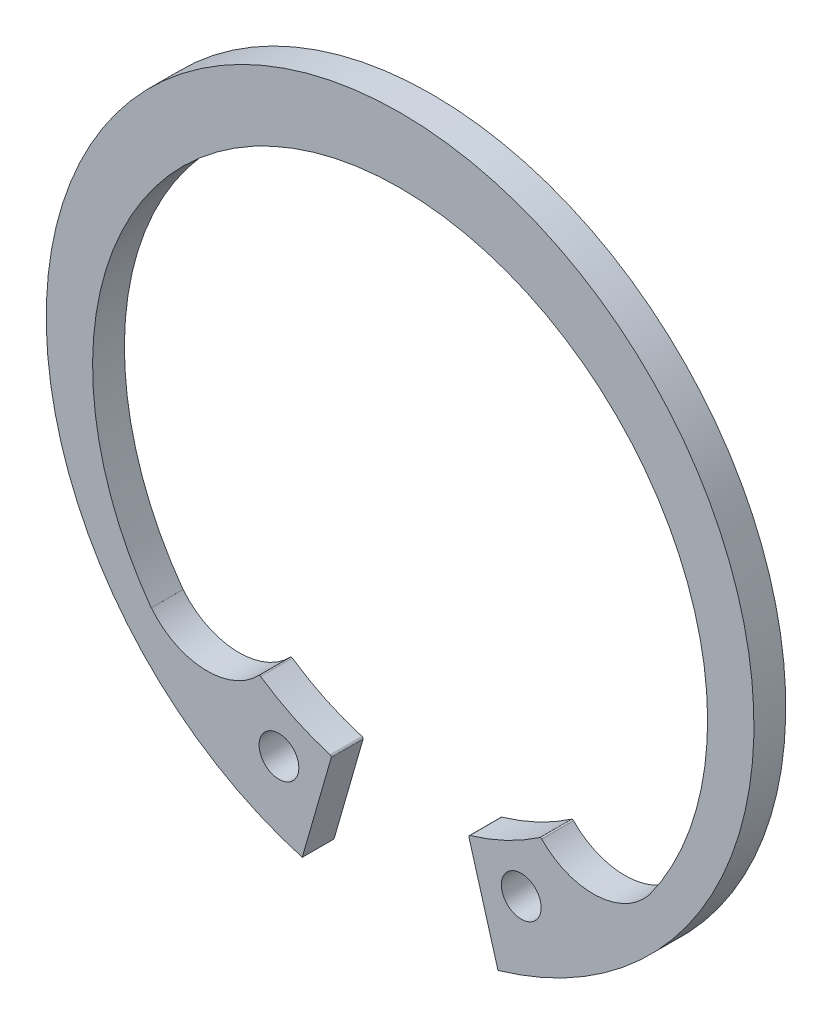
ISO-10303-21;
HEADER;
FILE_DESCRIPTION(('STEP AP214'),'2;1');
FILE_NAME('part.step','',(''),(''),'','','');
FILE_SCHEMA(('AUTOMOTIVE_DESIGN { 1 0 10303 214 1 1 1 1 }'));
ENDSEC;
DATA;
#1=APPLICATION_CONTEXT('core data for automotive mechanical design processes');
#2=APPLICATION_PROTOCOL_DEFINITION('international standard','automotive_design',2000,#1);
#3=PRODUCT_CONTEXT('',#1,'mechanical');
#4=PRODUCT('Part','Part','',(#3));
#5=PRODUCT_RELATED_PRODUCT_CATEGORY('part','',(#4));
#6=PRODUCT_DEFINITION_FORMATION('','',#4);
#7=PRODUCT_DEFINITION_CONTEXT('part definition',#1,'design');
#8=PRODUCT_DEFINITION('design','',#6,#7);
#9=PRODUCT_DEFINITION_SHAPE('','',#8);
#10=(LENGTH_UNIT() NAMED_UNIT(*) SI_UNIT(.MILLI.,.METRE.));
#11=(NAMED_UNIT(*) PLANE_ANGLE_UNIT() SI_UNIT($,.RADIAN.));
#12=(NAMED_UNIT(*) SI_UNIT($,.STERADIAN.) SOLID_ANGLE_UNIT());
#13=UNCERTAINTY_MEASURE_WITH_UNIT(LENGTH_MEASURE(1.E-05),#10,'distance_accuracy_value','');
#14=(GEOMETRIC_REPRESENTATION_CONTEXT(3) GLOBAL_UNCERTAINTY_ASSIGNED_CONTEXT((#13)) GLOBAL_UNIT_ASSIGNED_CONTEXT((#10,
#11,#12)) REPRESENTATION_CONTEXT('',''));
#15=CARTESIAN_POINT('',(0.,0.,0.));
#16=DIRECTION('',(0.,0.,1.));
#17=DIRECTION('',(1.,0.,0.));
#18=AXIS2_PLACEMENT_3D('',#15,#16,#17);
#19=CARTESIAN_POINT('',(0.,0.,-2.));
#20=DIRECTION('',(0.,0.,1.));
#21=DIRECTION('',(1.,0.,0.));
#22=AXIS2_PLACEMENT_3D('',#19,#20,#21);
#23=CYLINDRICAL_SURFACE('',#22,22.25);
#24=CARTESIAN_POINT('',(0.,0.,-2.));
#25=DIRECTION('',(0.,0.,1.));
#26=DIRECTION('',(1.,0.,0.));
#27=AXIS2_PLACEMENT_3D('',#24,#25,#26);
#28=CIRCLE('',#27,22.25);
#29=CARTESIAN_POINT('',(6.15473831044329,-21.3818076020238,-2.));
#30=VERTEX_POINT('',#29);
#31=CARTESIAN_POINT('',(-6.15473831044329,-21.3818076020238,-2.));
#32=VERTEX_POINT('',#31);
#33=EDGE_CURVE('E146',#30,#32,#28,.T.);
#34=ORIENTED_EDGE('',*,*,#33,.T.);
#35=DIRECTION('',(0.,0.,1.));
#36=VECTOR('',#35,1.);
#37=CARTESIAN_POINT('',(-6.15473831044329,-21.3818076020238,-2.));
#38=LINE('',#37,#36);
#39=CARTESIAN_POINT('',(-6.15473831044329,-21.3818076020238,0.));
#40=VERTEX_POINT('',#39);
#41=EDGE_CURVE('E36',#32,#40,#38,.T.);
#42=ORIENTED_EDGE('',*,*,#41,.T.);
#43=CARTESIAN_POINT('',(0.,0.,0.));
#44=DIRECTION('',(0.,0.,1.));
#45=DIRECTION('',(1.,0.,0.));
#46=AXIS2_PLACEMENT_3D('',#43,#44,#45);
#47=CIRCLE('',#46,22.25);
#48=CARTESIAN_POINT('',(6.15473831044329,-21.3818076020238,0.));
#49=VERTEX_POINT('',#48);
#50=EDGE_CURVE('E57',#49,#40,#47,.T.);
#51=ORIENTED_EDGE('',*,*,#50,.F.);
#52=DIRECTION('',(0.,0.,1.));
#53=VECTOR('',#52,1.);
#54=CARTESIAN_POINT('',(6.15473831044329,-21.3818076020238,-2.));
#55=LINE('',#54,#53);
#56=EDGE_CURVE('E11',#30,#49,#55,.T.);
#57=ORIENTED_EDGE('',*,*,#56,.F.);
#58=EDGE_LOOP('',(#34,#42,#51,#57));
#59=FACE_BOUND('',#58,.T.);
#60=ADVANCED_FACE('F33',(#59),#23,.T.);
#61=CARTESIAN_POINT('',(6.15473831044329,-21.3818076020238,-2.));
#62=DIRECTION('',(-0.960980116944889,-0.276617452154755,0.));
#63=DIRECTION('',(0.276617452154755,-0.960980116944889,0.));
#64=AXIS2_PLACEMENT_3D('',#61,#62,#63);
#65=PLANE('',#64);
#66=DIRECTION('',(0.276617452154755,-0.960980116944889,0.));
#67=VECTOR('',#66,1.);
#68=CARTESIAN_POINT('',(6.15473831044329,-21.3818076020238,0.));
#69=LINE('',#68,#67);
#70=CARTESIAN_POINT('',(4.328974749137,-15.039031804652,0.));
#71=VERTEX_POINT('',#70);
#72=EDGE_CURVE('E249',#71,#49,#69,.T.);
#73=ORIENTED_EDGE('',*,*,#72,.F.);
#74=DIRECTION('',(0.,0.,1.));
#75=VECTOR('',#74,1.);
#76=CARTESIAN_POINT('',(4.328974749137,-15.039031804652,-2.));
#77=LINE('',#76,#75);
#78=CARTESIAN_POINT('',(4.328974749137,-15.039031804652,-2.));
#79=VERTEX_POINT('',#78);
#80=EDGE_CURVE('E222',#79,#71,#77,.T.);
#81=ORIENTED_EDGE('',*,*,#80,.F.);
#82=DIRECTION('',(0.276617452154755,-0.960980116944889,0.));
#83=VECTOR('',#82,1.);
#84=CARTESIAN_POINT('',(6.15473831044329,-21.3818076020238,-2.));
#85=LINE('',#84,#83);
#86=EDGE_CURVE('E252',#79,#30,#85,.T.);
#87=ORIENTED_EDGE('',*,*,#86,.T.);
#88=ORIENTED_EDGE('',*,*,#56,.T.);
#89=EDGE_LOOP('',(#73,#81,#87,#88));
#90=FACE_BOUND('',#89,.T.);
#91=ADVANCED_FACE('F265',(#90),#65,.T.);
#92=CARTESIAN_POINT('',(0.,-1.18524064145101,-2.));
#93=DIRECTION('',(0.,0.,1.));
#94=DIRECTION('',(1.,0.,0.));
#95=AXIS2_PLACEMENT_3D('',#92,#93,#94);
#96=CYLINDRICAL_SURFACE('',#95,19.335240641451);
#97=DIRECTION('',(0.,0.,1.));
#98=VECTOR('',#97,1.);
#99=CARTESIAN_POINT('',(-15.6473452554043,-12.543590747034,-2.));
#100=LINE('',#99,#98);
#101=CARTESIAN_POINT('',(-15.6473452554043,-12.543590747034,-2.));
#102=VERTEX_POINT('',#101);
#103=CARTESIAN_POINT('',(-15.6473452554043,-12.543590747034,0.));
#104=VERTEX_POINT('',#103);
#105=EDGE_CURVE('E187',#102,#104,#100,.T.);
#106=ORIENTED_EDGE('',*,*,#105,.F.);
#107=CARTESIAN_POINT('',(0.,-1.18524064145101,-2.));
#108=DIRECTION('',(0.,0.,-1.));
#109=DIRECTION('',(1.,0.,0.));
#110=AXIS2_PLACEMENT_3D('',#107,#108,#109);
#111=CIRCLE('',#110,19.335240641451);
#112=CARTESIAN_POINT('',(15.6473452554043,-12.543590747034,-2.));
#113=VERTEX_POINT('',#112);
#114=EDGE_CURVE('E65',#102,#113,#111,.T.);
#115=ORIENTED_EDGE('',*,*,#114,.T.);
#116=DIRECTION('',(0.,0.,1.));
#117=VECTOR('',#116,1.);
#118=CARTESIAN_POINT('',(15.6473452554043,-12.543590747034,-2.));
#119=LINE('',#118,#117);
#120=CARTESIAN_POINT('',(15.6473452554043,-12.543590747034,0.));
#121=VERTEX_POINT('',#120);
#122=EDGE_CURVE('E225',#121,#113,#119,.F.);
#123=ORIENTED_EDGE('',*,*,#122,.F.);
#124=CARTESIAN_POINT('',(0.,-1.18524064145101,0.));
#125=DIRECTION('',(0.,0.,-1.));
#126=DIRECTION('',(1.,0.,0.));
#127=AXIS2_PLACEMENT_3D('',#124,#125,#126);
#128=CIRCLE('',#127,19.335240641451);
#129=EDGE_CURVE('E258',#104,#121,#128,.T.);
#130=ORIENTED_EDGE('',*,*,#129,.F.);
#131=EDGE_LOOP('',(#106,#115,#123,#130));
#132=FACE_BOUND('',#131,.T.);
#133=ADVANCED_FACE('F287',(#132),#96,.F.);
#134=CARTESIAN_POINT('',(-6.15473831044329,-21.3818076020238,-2.));
#135=DIRECTION('',(0.960980116944889,-0.276617452154754,0.));
#136=DIRECTION('',(0.276617452154754,0.960980116944889,0.));
#137=AXIS2_PLACEMENT_3D('',#134,#135,#136);
#138=PLANE('',#137);
#139=DIRECTION('',(0.276617452154754,0.960980116944889,0.));
#140=VECTOR('',#139,1.);
#141=CARTESIAN_POINT('',(-6.15473831044329,-21.3818076020238,0.));
#142=LINE('',#141,#140);
#143=CARTESIAN_POINT('',(-4.32897474913701,-15.039031804652,0.));
#144=VERTEX_POINT('',#143);
#145=EDGE_CURVE('E256',#40,#144,#142,.T.);
#146=ORIENTED_EDGE('',*,*,#145,.F.);
#147=ORIENTED_EDGE('',*,*,#41,.F.);
#148=DIRECTION('',(0.276617452154754,0.960980116944889,0.));
#149=VECTOR('',#148,1.);
#150=CARTESIAN_POINT('',(-6.15473831044329,-21.3818076020238,-2.));
#151=LINE('',#150,#149);
#152=CARTESIAN_POINT('',(-4.32897474913701,-15.039031804652,-2.));
#153=VERTEX_POINT('',#152);
#154=EDGE_CURVE('E138',#32,#153,#151,.T.);
#155=ORIENTED_EDGE('',*,*,#154,.T.);
#156=DIRECTION('',(0.,0.,1.));
#157=VECTOR('',#156,1.);
#158=CARTESIAN_POINT('',(-4.32897474913701,-15.039031804652,-2.));
#159=LINE('',#158,#157);
#160=EDGE_CURVE('E142',#153,#144,#159,.T.);
#161=ORIENTED_EDGE('',*,*,#160,.T.);
#162=EDGE_LOOP('',(#146,#147,#155,#161));
#163=FACE_BOUND('',#162,.T.);
#164=ADVANCED_FACE('F141',(#163),#138,.T.);
#165=CARTESIAN_POINT('',(0.,0.,-2.));
#166=DIRECTION('',(0.,0.,1.));
#167=DIRECTION('',(1.,0.,0.));
#168=AXIS2_PLACEMENT_3D('',#165,#166,#167);
#169=PLANE('',#168);
#170=ORIENTED_EDGE('',*,*,#114,.F.);
#171=DIRECTION('',(-0.78024293702062,-0.625476585676425,0.));
#172=VECTOR('',#171,1.);
#173=CARTESIAN_POINT('',(-17.3604053487088,-13.9168540313004,-2.));
#174=LINE('',#173,#172);
#175=CARTESIAN_POINT('',(-15.6421026028344,-12.5393880093049,-2.));
#176=VERTEX_POINT('',#175);
#177=EDGE_CURVE('E156',#176,#102,#174,.T.);
#178=ORIENTED_EDGE('',*,*,#177,.F.);
#179=CARTESIAN_POINT('',(-12.1327776706706,-9.72616090726839,-2.));
#180=DIRECTION('',(0.,0.,-1.));
#181=DIRECTION('',(1.,0.,0.));
#182=AXIS2_PLACEMENT_3D('',#179,#180,#181);
#183=CIRCLE('',#182,4.49773367454533);
#184=CARTESIAN_POINT('',(-8.899741793402,-12.8529943251902,-2.));
#185=VERTEX_POINT('',#184);
#186=EDGE_CURVE('E173',#185,#176,#183,.T.);
#187=ORIENTED_EDGE('',*,*,#186,.F.);
#188=CARTESIAN_POINT('',(-8.82786035018614,-12.9225145245657,-2.));
#189=DIRECTION('',(0.,0.,1.));
#190=DIRECTION('',(1.,0.,0.));
#191=AXIS2_PLACEMENT_3D('',#188,#189,#190);
#192=CIRCLE('',#191,0.0999999999999992);
#193=CARTESIAN_POINT('',(-8.77145229683032,-12.839942546773,-2.));
#194=VERTEX_POINT('',#193);
#195=EDGE_CURVE('E165',#194,#185,#192,.T.);
#196=ORIENTED_EDGE('',*,*,#195,.F.);
#197=CARTESIAN_POINT('',(0.,0.,-2.));
#198=DIRECTION('',(0.,0.,-1.));
#199=DIRECTION('',(1.,0.,0.));
#200=AXIS2_PLACEMENT_3D('',#197,#198,#199);
#201=CIRCLE('',#200,15.55);
#202=CARTESIAN_POINT('',(-4.39679753552267,-14.9154507619321,-2.));
#203=VERTEX_POINT('',#202);
#204=EDGE_CURVE('E161',#203,#194,#201,.T.);
#205=ORIENTED_EDGE('',*,*,#204,.F.);
#206=CARTESIAN_POINT('',(-4.4250727608315,-15.0113700594365,-2.));
#207=DIRECTION('',(0.,0.,1.));
#208=DIRECTION('',(-1.,0.,0.));
#209=AXIS2_PLACEMENT_3D('',#206,#207,#208);
#210=CIRCLE('',#209,0.0999999999999982);
#211=EDGE_CURVE('E152',#153,#203,#210,.T.);
#212=ORIENTED_EDGE('',*,*,#211,.F.);
#213=ORIENTED_EDGE('',*,*,#154,.F.);
#214=ORIENTED_EDGE('',*,*,#33,.F.);
#215=ORIENTED_EDGE('',*,*,#86,.F.);
#216=CARTESIAN_POINT('',(4.42507276083149,-15.0113700594365,-2.));
#217=DIRECTION('',(0.,0.,1.));
#218=DIRECTION('',(1.,0.,0.));
#219=AXIS2_PLACEMENT_3D('',#216,#217,#218);
#220=CIRCLE('',#219,0.0999999999999982);
#221=CARTESIAN_POINT('',(4.39679753552267,-14.9154507619321,-2.));
#222=VERTEX_POINT('',#221);
#223=EDGE_CURVE('E207',#222,#79,#220,.T.);
#224=ORIENTED_EDGE('',*,*,#223,.F.);
#225=CARTESIAN_POINT('',(0.,0.,-2.));
#226=DIRECTION('',(0.,0.,-1.));
#227=DIRECTION('',(1.,0.,0.));
#228=AXIS2_PLACEMENT_3D('',#225,#226,#227);
#229=CIRCLE('',#228,15.55);
#230=CARTESIAN_POINT('',(8.77145229683032,-12.839942546773,-2.));
#231=VERTEX_POINT('',#230);
#232=EDGE_CURVE('E205',#231,#222,#229,.T.);
#233=ORIENTED_EDGE('',*,*,#232,.F.);
#234=CARTESIAN_POINT('',(8.82786035018614,-12.9225145245657,-2.));
#235=DIRECTION('',(0.,0.,1.));
#236=DIRECTION('',(-1.,0.,0.));
#237=AXIS2_PLACEMENT_3D('',#234,#235,#236);
#238=CIRCLE('',#237,0.0999999999999992);
#239=CARTESIAN_POINT('',(8.899741793402,-12.8529943251902,-2.));
#240=VERTEX_POINT('',#239);
#241=EDGE_CURVE('E202',#240,#231,#238,.T.);
#242=ORIENTED_EDGE('',*,*,#241,.F.);
#243=CARTESIAN_POINT('',(12.1327776706706,-9.72616090726839,-2.));
#244=DIRECTION('',(0.,0.,-1.));
#245=DIRECTION('',(1.,0.,0.));
#246=AXIS2_PLACEMENT_3D('',#243,#244,#245);
#247=CIRCLE('',#246,4.49773367454533);
#248=CARTESIAN_POINT('',(15.6421026028344,-12.5393880093049,-2.));
#249=VERTEX_POINT('',#248);
#250=EDGE_CURVE('E198',#249,#240,#247,.T.);
#251=ORIENTED_EDGE('',*,*,#250,.F.);
#252=DIRECTION('',(-0.78024293702062,0.625476585676425,0.));
#253=VECTOR('',#252,1.);
#254=CARTESIAN_POINT('',(15.6421026028344,-12.5393880093049,-2.));
#255=LINE('',#254,#253);
#256=EDGE_CURVE('E196',#113,#249,#255,.T.);
#257=ORIENTED_EDGE('',*,*,#256,.F.);
#258=EDGE_LOOP('',(#170,#178,#187,#196,#205,#212,#213,#214,#215,#224,#233,#242,#251,#257));
#259=FACE_BOUND('',#258,.T.);
#260=CARTESIAN_POINT('',(7.61734029213351,-16.6117955644126,-2.));
#261=DIRECTION('',(0.,0.,1.));
#262=DIRECTION('',(1.,0.,0.));
#263=AXIS2_PLACEMENT_3D('',#260,#261,#262);
#264=CIRCLE('',#263,1.25);
#265=CARTESIAN_POINT('',(8.86734029213351,-16.6117955644126,-2.));
#266=VERTEX_POINT('',#265);
#267=EDGE_CURVE('E244',#266,#266,#264,.T.);
#268=ORIENTED_EDGE('',*,*,#267,.T.);
#269=EDGE_LOOP('',(#268));
#270=FACE_BOUND('',#269,.T.);
#271=CARTESIAN_POINT('',(-7.61734029213351,-16.6117955644126,-2.));
#272=DIRECTION('',(0.,0.,1.));
#273=DIRECTION('',(1.,0.,0.));
#274=AXIS2_PLACEMENT_3D('',#271,#272,#273);
#275=CIRCLE('',#274,1.25);
#276=CARTESIAN_POINT('',(-6.36734029213351,-16.6117955644126,-2.));
#277=VERTEX_POINT('',#276);
#278=EDGE_CURVE('E238',#277,#277,#275,.T.);
#279=ORIENTED_EDGE('',*,*,#278,.T.);
#280=EDGE_LOOP('',(#279));
#281=FACE_BOUND('',#280,.T.);
#282=ADVANCED_FACE('F158',(#259,#270,#281),#169,.F.);
#283=CARTESIAN_POINT('',(0.,0.,0.));
#284=DIRECTION('',(0.,0.,1.));
#285=DIRECTION('',(1.,0.,0.));
#286=AXIS2_PLACEMENT_3D('',#283,#284,#285);
#287=PLANE('',#286);
#288=DIRECTION('',(-0.78024293702062,-0.625476585676425,0.));
#289=VECTOR('',#288,1.);
#290=CARTESIAN_POINT('',(-17.3604053487088,-13.9168540313004,0.));
#291=LINE('',#290,#289);
#292=CARTESIAN_POINT('',(-15.6421026028344,-12.5393880093049,0.));
#293=VERTEX_POINT('',#292);
#294=EDGE_CURVE('E163',#293,#104,#291,.T.);
#295=ORIENTED_EDGE('',*,*,#294,.T.);
#296=ORIENTED_EDGE('',*,*,#129,.T.);
#297=DIRECTION('',(-0.78024293702062,0.625476585676425,0.));
#298=VECTOR('',#297,1.);
#299=CARTESIAN_POINT('',(15.6421026028344,-12.5393880093049,0.));
#300=LINE('',#299,#298);
#301=CARTESIAN_POINT('',(15.6421026028344,-12.5393880093049,0.));
#302=VERTEX_POINT('',#301);
#303=EDGE_CURVE('E195',#121,#302,#300,.T.);
#304=ORIENTED_EDGE('',*,*,#303,.T.);
#305=CARTESIAN_POINT('',(12.1327776706706,-9.72616090726839,0.));
#306=DIRECTION('',(0.,0.,-1.));
#307=DIRECTION('',(1.,0.,0.));
#308=AXIS2_PLACEMENT_3D('',#305,#306,#307);
#309=CIRCLE('',#308,4.49773367454533);
#310=CARTESIAN_POINT('',(8.899741793402,-12.8529943251902,0.));
#311=VERTEX_POINT('',#310);
#312=EDGE_CURVE('E212',#302,#311,#309,.T.);
#313=ORIENTED_EDGE('',*,*,#312,.T.);
#314=CARTESIAN_POINT('',(8.82786035018614,-12.9225145245657,0.));
#315=DIRECTION('',(0.,0.,1.));
#316=DIRECTION('',(-1.,0.,0.));
#317=AXIS2_PLACEMENT_3D('',#314,#315,#316);
#318=CIRCLE('',#317,0.0999999999999992);
#319=CARTESIAN_POINT('',(8.77145229683032,-12.839942546773,0.));
#320=VERTEX_POINT('',#319);
#321=EDGE_CURVE('E215',#311,#320,#318,.T.);
#322=ORIENTED_EDGE('',*,*,#321,.T.);
#323=CARTESIAN_POINT('',(0.,0.,0.));
#324=DIRECTION('',(0.,0.,-1.));
#325=DIRECTION('',(1.,0.,0.));
#326=AXIS2_PLACEMENT_3D('',#323,#324,#325);
#327=CIRCLE('',#326,15.55);
#328=CARTESIAN_POINT('',(4.39679753552267,-14.9154507619321,0.));
#329=VERTEX_POINT('',#328);
#330=EDGE_CURVE('E218',#320,#329,#327,.T.);
#331=ORIENTED_EDGE('',*,*,#330,.T.);
#332=CARTESIAN_POINT('',(4.42507276083149,-15.0113700594365,0.));
#333=DIRECTION('',(0.,0.,1.));
#334=DIRECTION('',(1.,0.,0.));
#335=AXIS2_PLACEMENT_3D('',#332,#333,#334);
#336=CIRCLE('',#335,0.0999999999999982);
#337=EDGE_CURVE('E199',#329,#71,#336,.T.);
#338=ORIENTED_EDGE('',*,*,#337,.T.);
#339=ORIENTED_EDGE('',*,*,#72,.T.);
#340=ORIENTED_EDGE('',*,*,#50,.T.);
#341=ORIENTED_EDGE('',*,*,#145,.T.);
#342=CARTESIAN_POINT('',(-4.4250727608315,-15.0113700594365,0.));
#343=DIRECTION('',(0.,0.,1.));
#344=DIRECTION('',(-1.,0.,0.));
#345=AXIS2_PLACEMENT_3D('',#342,#343,#344);
#346=CIRCLE('',#345,0.0999999999999982);
#347=CARTESIAN_POINT('',(-4.39679753552267,-14.9154507619321,0.));
#348=VERTEX_POINT('',#347);
#349=EDGE_CURVE('E154',#144,#348,#346,.T.);
#350=ORIENTED_EDGE('',*,*,#349,.T.);
#351=CARTESIAN_POINT('',(0.,0.,0.));
#352=DIRECTION('',(0.,0.,-1.));
#353=DIRECTION('',(1.,0.,0.));
#354=AXIS2_PLACEMENT_3D('',#351,#352,#353);
#355=CIRCLE('',#354,15.55);
#356=CARTESIAN_POINT('',(-8.77145229683032,-12.839942546773,0.));
#357=VERTEX_POINT('',#356);
#358=EDGE_CURVE('E178',#348,#357,#355,.T.);
#359=ORIENTED_EDGE('',*,*,#358,.T.);
#360=CARTESIAN_POINT('',(-8.82786035018614,-12.9225145245657,0.));
#361=DIRECTION('',(0.,0.,1.));
#362=DIRECTION('',(1.,0.,0.));
#363=AXIS2_PLACEMENT_3D('',#360,#361,#362);
#364=CIRCLE('',#363,0.0999999999999992);
#365=CARTESIAN_POINT('',(-8.899741793402,-12.8529943251902,0.));
#366=VERTEX_POINT('',#365);
#367=EDGE_CURVE('E180',#357,#366,#364,.T.);
#368=ORIENTED_EDGE('',*,*,#367,.T.);
#369=CARTESIAN_POINT('',(-12.1327776706706,-9.72616090726839,0.));
#370=DIRECTION('',(0.,0.,-1.));
#371=DIRECTION('',(1.,0.,0.));
#372=AXIS2_PLACEMENT_3D('',#369,#370,#371);
#373=CIRCLE('',#372,4.49773367454533);
#374=EDGE_CURVE('E168',#366,#293,#373,.T.);
#375=ORIENTED_EDGE('',*,*,#374,.T.);
#376=EDGE_LOOP('',(#295,#296,#304,#313,#322,#331,#338,#339,#340,#341,#350,#359,#368,#375));
#377=FACE_BOUND('',#376,.T.);
#378=CARTESIAN_POINT('',(7.61734029213351,-16.6117955644126,0.));
#379=DIRECTION('',(0.,0.,1.));
#380=DIRECTION('',(1.,0.,0.));
#381=AXIS2_PLACEMENT_3D('',#378,#379,#380);
#382=CIRCLE('',#381,1.25);
#383=CARTESIAN_POINT('',(8.86734029213351,-16.6117955644126,0.));
#384=VERTEX_POINT('',#383);
#385=EDGE_CURVE('E241',#384,#384,#382,.T.);
#386=ORIENTED_EDGE('',*,*,#385,.F.);
#387=EDGE_LOOP('',(#386));
#388=FACE_BOUND('',#387,.T.);
#389=CARTESIAN_POINT('',(-7.61734029213351,-16.6117955644126,0.));
#390=DIRECTION('',(0.,0.,1.));
#391=DIRECTION('',(1.,0.,0.));
#392=AXIS2_PLACEMENT_3D('',#389,#390,#391);
#393=CIRCLE('',#392,1.25);
#394=CARTESIAN_POINT('',(-6.36734029213351,-16.6117955644126,0.));
#395=VERTEX_POINT('',#394);
#396=EDGE_CURVE('E237',#395,#395,#393,.T.);
#397=ORIENTED_EDGE('',*,*,#396,.F.);
#398=EDGE_LOOP('',(#397));
#399=FACE_BOUND('',#398,.T.);
#400=ADVANCED_FACE('F260',(#377,#388,#399),#287,.T.);
#401=CARTESIAN_POINT('',(7.61734029213351,-16.6117955644126,-2.));
#402=DIRECTION('',(0.,0.,1.));
#403=DIRECTION('',(1.,0.,0.));
#404=AXIS2_PLACEMENT_3D('',#401,#402,#403);
#405=CYLINDRICAL_SURFACE('',#404,1.25);
#406=ORIENTED_EDGE('',*,*,#267,.F.);
#407=EDGE_LOOP('',(#406));
#408=FACE_BOUND('',#407,.T.);
#409=ORIENTED_EDGE('',*,*,#385,.T.);
#410=EDGE_LOOP('',(#409));
#411=FACE_BOUND('',#410,.T.);
#412=ADVANCED_FACE('F310',(#408,#411),#405,.F.);
#413=CARTESIAN_POINT('',(-7.61734029213351,-16.6117955644126,-2.));
#414=DIRECTION('',(0.,0.,1.));
#415=DIRECTION('',(1.,0.,0.));
#416=AXIS2_PLACEMENT_3D('',#413,#414,#415);
#417=CYLINDRICAL_SURFACE('',#416,1.25);
#418=ORIENTED_EDGE('',*,*,#278,.F.);
#419=EDGE_LOOP('',(#418));
#420=FACE_BOUND('',#419,.T.);
#421=ORIENTED_EDGE('',*,*,#396,.T.);
#422=EDGE_LOOP('',(#421));
#423=FACE_BOUND('',#422,.T.);
#424=ADVANCED_FACE('F303',(#420,#423),#417,.F.);
#425=CARTESIAN_POINT('',(0.,0.,-2.));
#426=DIRECTION('',(0.,0.,1.));
#427=DIRECTION('',(1.,0.,0.));
#428=AXIS2_PLACEMENT_3D('',#425,#426,#427);
#429=CYLINDRICAL_SURFACE('',#428,15.55);
#430=ORIENTED_EDGE('',*,*,#330,.F.);
#431=DIRECTION('',(0.,0.,1.));
#432=VECTOR('',#431,1.);
#433=CARTESIAN_POINT('',(8.77145229683032,-12.839942546773,-2.));
#434=LINE('',#433,#432);
#435=EDGE_CURVE('E229',#231,#320,#434,.T.);
#436=ORIENTED_EDGE('',*,*,#435,.F.);
#437=ORIENTED_EDGE('',*,*,#232,.T.);
#438=DIRECTION('',(0.,0.,1.));
#439=VECTOR('',#438,1.);
#440=CARTESIAN_POINT('',(4.39679753552267,-14.9154507619321,-2.));
#441=LINE('',#440,#439);
#442=EDGE_CURVE('E226',#222,#329,#441,.T.);
#443=ORIENTED_EDGE('',*,*,#442,.T.);
#444=EDGE_LOOP('',(#430,#436,#437,#443));
#445=FACE_BOUND('',#444,.T.);
#446=ADVANCED_FACE('F301',(#445),#429,.F.);
#447=CARTESIAN_POINT('',(4.42507276083149,-15.0113700594365,-2.));
#448=DIRECTION('',(0.,0.,1.));
#449=DIRECTION('',(1.,0.,0.));
#450=AXIS2_PLACEMENT_3D('',#447,#448,#449);
#451=CYLINDRICAL_SURFACE('',#450,0.0999999999999982);
#452=ORIENTED_EDGE('',*,*,#337,.F.);
#453=ORIENTED_EDGE('',*,*,#442,.F.);
#454=ORIENTED_EDGE('',*,*,#223,.T.);
#455=ORIENTED_EDGE('',*,*,#80,.T.);
#456=EDGE_LOOP('',(#452,#453,#454,#455));
#457=FACE_BOUND('',#456,.T.);
#458=ADVANCED_FACE('F267',(#457),#451,.T.);
#459=CARTESIAN_POINT('',(8.82786035018614,-12.9225145245657,-2.));
#460=DIRECTION('',(0.,0.,1.));
#461=DIRECTION('',(1.,0.,0.));
#462=AXIS2_PLACEMENT_3D('',#459,#460,#461);
#463=CYLINDRICAL_SURFACE('',#462,0.0999999999999992);
#464=ORIENTED_EDGE('',*,*,#321,.F.);
#465=DIRECTION('',(0.,0.,1.));
#466=VECTOR('',#465,1.);
#467=CARTESIAN_POINT('',(8.899741793402,-12.8529943251902,-2.));
#468=LINE('',#467,#466);
#469=EDGE_CURVE('E232',#240,#311,#468,.T.);
#470=ORIENTED_EDGE('',*,*,#469,.F.);
#471=ORIENTED_EDGE('',*,*,#241,.T.);
#472=ORIENTED_EDGE('',*,*,#435,.T.);
#473=EDGE_LOOP('',(#464,#470,#471,#472));
#474=FACE_BOUND('',#473,.T.);
#475=ADVANCED_FACE('F299',(#474),#463,.T.);
#476=CARTESIAN_POINT('',(12.1327776706706,-9.72616090726839,-2.));
#477=DIRECTION('',(0.,0.,1.));
#478=DIRECTION('',(1.,0.,0.));
#479=AXIS2_PLACEMENT_3D('',#476,#477,#478);
#480=CYLINDRICAL_SURFACE('',#479,4.49773367454533);
#481=ORIENTED_EDGE('',*,*,#312,.F.);
#482=DIRECTION('',(0.,0.,1.));
#483=VECTOR('',#482,1.);
#484=CARTESIAN_POINT('',(15.6421026028344,-12.5393880093049,-2.));
#485=LINE('',#484,#483);
#486=EDGE_CURVE('E210',#249,#302,#485,.T.);
#487=ORIENTED_EDGE('',*,*,#486,.F.);
#488=ORIENTED_EDGE('',*,*,#250,.T.);
#489=ORIENTED_EDGE('',*,*,#469,.T.);
#490=EDGE_LOOP('',(#481,#487,#488,#489));
#491=FACE_BOUND('',#490,.T.);
#492=ADVANCED_FACE('F296',(#491),#480,.F.);
#493=CARTESIAN_POINT('',(15.6421026028344,-12.5393880093049,-2.));
#494=DIRECTION('',(0.625476585676425,0.78024293702062,0.));
#495=DIRECTION('',(-0.78024293702062,0.625476585676425,0.));
#496=AXIS2_PLACEMENT_3D('',#493,#494,#495);
#497=PLANE('',#496);
#498=ORIENTED_EDGE('',*,*,#303,.F.);
#499=ORIENTED_EDGE('',*,*,#122,.T.);
#500=ORIENTED_EDGE('',*,*,#256,.T.);
#501=ORIENTED_EDGE('',*,*,#486,.T.);
#502=EDGE_LOOP('',(#498,#499,#500,#501));
#503=FACE_BOUND('',#502,.T.);
#504=ADVANCED_FACE('F293',(#503),#497,.T.);
#505=CARTESIAN_POINT('',(0.,0.,-2.));
#506=DIRECTION('',(0.,0.,1.));
#507=DIRECTION('',(1.,0.,0.));
#508=AXIS2_PLACEMENT_3D('',#505,#506,#507);
#509=CYLINDRICAL_SURFACE('',#508,15.55);
#510=ORIENTED_EDGE('',*,*,#358,.F.);
#511=DIRECTION('',(0.,0.,1.));
#512=VECTOR('',#511,1.);
#513=CARTESIAN_POINT('',(-4.39679753552267,-14.9154507619321,-2.));
#514=LINE('',#513,#512);
#515=EDGE_CURVE('E155',#203,#348,#514,.T.);
#516=ORIENTED_EDGE('',*,*,#515,.F.);
#517=ORIENTED_EDGE('',*,*,#204,.T.);
#518=DIRECTION('',(0.,0.,1.));
#519=VECTOR('',#518,1.);
#520=CARTESIAN_POINT('',(-8.77145229683032,-12.839942546773,-2.));
#521=LINE('',#520,#519);
#522=EDGE_CURVE('E190',#194,#357,#521,.T.);
#523=ORIENTED_EDGE('',*,*,#522,.T.);
#524=EDGE_LOOP('',(#510,#516,#517,#523));
#525=FACE_BOUND('',#524,.T.);
#526=ADVANCED_FACE('F275',(#525),#509,.F.);
#527=CARTESIAN_POINT('',(-17.3604053487088,-13.9168540313004,-2.));
#528=DIRECTION('',(-0.625476585676425,0.78024293702062,0.));
#529=DIRECTION('',(-0.78024293702062,-0.625476585676425,0.));
#530=AXIS2_PLACEMENT_3D('',#527,#528,#529);
#531=PLANE('',#530);
#532=ORIENTED_EDGE('',*,*,#177,.T.);
#533=ORIENTED_EDGE('',*,*,#105,.T.);
#534=ORIENTED_EDGE('',*,*,#294,.F.);
#535=DIRECTION('',(0.,0.,1.));
#536=VECTOR('',#535,1.);
#537=CARTESIAN_POINT('',(-15.6421026028344,-12.5393880093049,-2.));
#538=LINE('',#537,#536);
#539=EDGE_CURVE('E185',#176,#293,#538,.T.);
#540=ORIENTED_EDGE('',*,*,#539,.F.);
#541=EDGE_LOOP('',(#532,#533,#534,#540));
#542=FACE_BOUND('',#541,.T.);
#543=ADVANCED_FACE('F285',(#542),#531,.T.);
#544=CARTESIAN_POINT('',(-12.1327776706706,-9.72616090726839,-2.));
#545=DIRECTION('',(0.,0.,1.));
#546=DIRECTION('',(1.,0.,0.));
#547=AXIS2_PLACEMENT_3D('',#544,#545,#546);
#548=CYLINDRICAL_SURFACE('',#547,4.49773367454533);
#549=ORIENTED_EDGE('',*,*,#374,.F.);
#550=DIRECTION('',(0.,0.,1.));
#551=VECTOR('',#550,1.);
#552=CARTESIAN_POINT('',(-8.899741793402,-12.8529943251902,-2.));
#553=LINE('',#552,#551);
#554=EDGE_CURVE('E188',#185,#366,#553,.T.);
#555=ORIENTED_EDGE('',*,*,#554,.F.);
#556=ORIENTED_EDGE('',*,*,#186,.T.);
#557=ORIENTED_EDGE('',*,*,#539,.T.);
#558=EDGE_LOOP('',(#549,#555,#556,#557));
#559=FACE_BOUND('',#558,.T.);
#560=ADVANCED_FACE('F281',(#559),#548,.F.);
#561=CARTESIAN_POINT('',(-8.82786035018614,-12.9225145245657,-2.));
#562=DIRECTION('',(0.,0.,1.));
#563=DIRECTION('',(1.,0.,0.));
#564=AXIS2_PLACEMENT_3D('',#561,#562,#563);
#565=CYLINDRICAL_SURFACE('',#564,0.0999999999999992);
#566=ORIENTED_EDGE('',*,*,#367,.F.);
#567=ORIENTED_EDGE('',*,*,#522,.F.);
#568=ORIENTED_EDGE('',*,*,#195,.T.);
#569=ORIENTED_EDGE('',*,*,#554,.T.);
#570=EDGE_LOOP('',(#566,#567,#568,#569));
#571=FACE_BOUND('',#570,.T.);
#572=ADVANCED_FACE('F277',(#571),#565,.T.);
#573=CARTESIAN_POINT('',(-4.4250727608315,-15.0113700594365,-2.));
#574=DIRECTION('',(0.,0.,1.));
#575=DIRECTION('',(1.,0.,0.));
#576=AXIS2_PLACEMENT_3D('',#573,#574,#575);
#577=CYLINDRICAL_SURFACE('',#576,0.0999999999999982);
#578=ORIENTED_EDGE('',*,*,#349,.F.);
#579=ORIENTED_EDGE('',*,*,#160,.F.);
#580=ORIENTED_EDGE('',*,*,#211,.T.);
#581=ORIENTED_EDGE('',*,*,#515,.T.);
#582=EDGE_LOOP('',(#578,#579,#580,#581));
#583=FACE_BOUND('',#582,.T.);
#584=ADVANCED_FACE('F150',(#583),#577,.T.);
#585=CLOSED_SHELL('',(#60,#91,#133,#164,#282,#400,#412,#424,#446,#458,#475,#492,#504,#526,#543,
#560,#572,#584));
#586=MANIFOLD_SOLID_BREP('B2',#585);
#587=ADVANCED_BREP_SHAPE_REPRESENTATION('',(#18,#586),#14);
#588=SHAPE_DEFINITION_REPRESENTATION(#9,#587);
ENDSEC;
END-ISO-10303-21;
